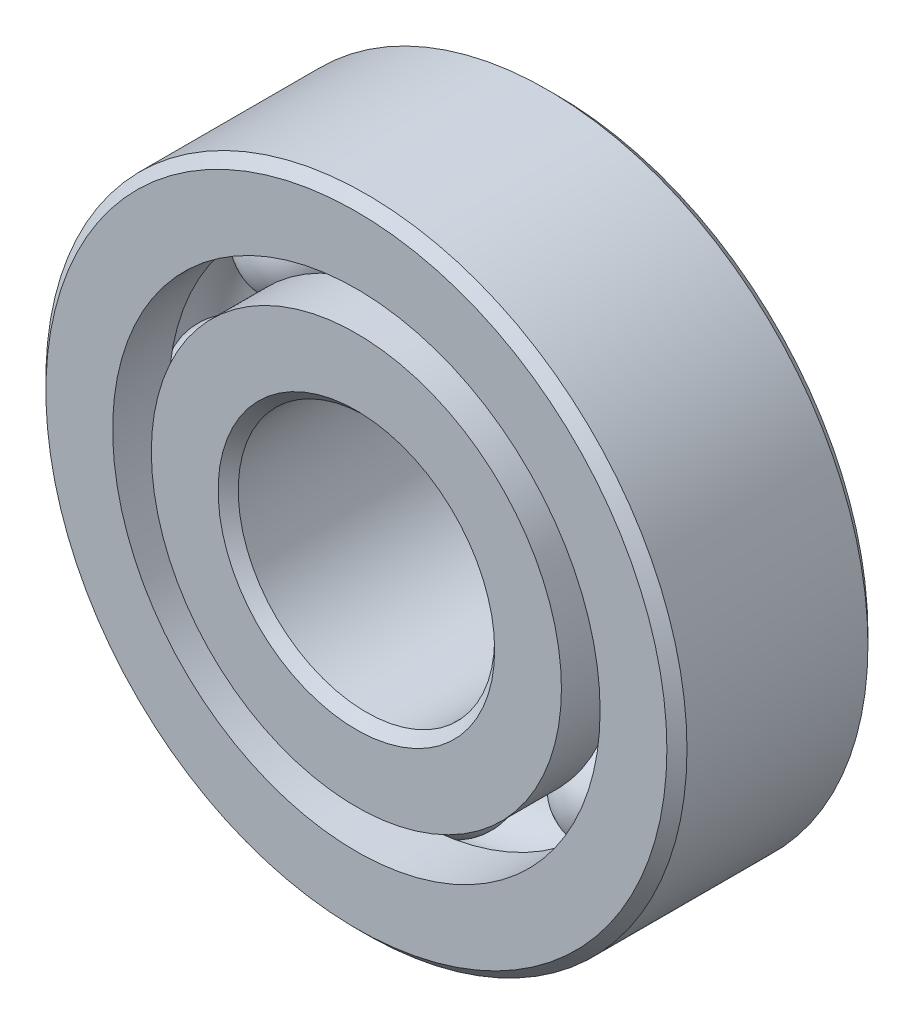
ISO-10303-21;
HEADER;
FILE_DESCRIPTION(('STEP AP214'),'2;1');
FILE_NAME('part.step','',(''),(''),'','','');
FILE_SCHEMA(('AUTOMOTIVE_DESIGN { 1 0 10303 214 1 1 1 1 }'));
ENDSEC;
DATA;
#1=APPLICATION_CONTEXT('core data for automotive mechanical design processes');
#2=APPLICATION_PROTOCOL_DEFINITION('international standard','automotive_design',2000,#1);
#3=PRODUCT_CONTEXT('',#1,'mechanical');
#4=PRODUCT('Part','Part','',(#3));
#5=PRODUCT_RELATED_PRODUCT_CATEGORY('part','',(#4));
#6=PRODUCT_DEFINITION_FORMATION('','',#4);
#7=PRODUCT_DEFINITION_CONTEXT('part definition',#1,'design');
#8=PRODUCT_DEFINITION('design','',#6,#7);
#9=PRODUCT_DEFINITION_SHAPE('','',#8);
#10=(LENGTH_UNIT() NAMED_UNIT(*) SI_UNIT(.MILLI.,.METRE.));
#11=(NAMED_UNIT(*) PLANE_ANGLE_UNIT() SI_UNIT($,.RADIAN.));
#12=(NAMED_UNIT(*) SI_UNIT($,.STERADIAN.) SOLID_ANGLE_UNIT());
#13=UNCERTAINTY_MEASURE_WITH_UNIT(LENGTH_MEASURE(1.E-05),#10,'distance_accuracy_value','');
#14=(GEOMETRIC_REPRESENTATION_CONTEXT(3) GLOBAL_UNCERTAINTY_ASSIGNED_CONTEXT((#13)) GLOBAL_UNIT_ASSIGNED_CONTEXT((#10,
#11,#12)) REPRESENTATION_CONTEXT('',''));
#15=CARTESIAN_POINT('',(0.,0.,0.));
#16=DIRECTION('',(0.,0.,1.));
#17=DIRECTION('',(1.,0.,0.));
#18=AXIS2_PLACEMENT_3D('',#15,#16,#17);
#19=CARTESIAN_POINT('',(-3.92886205296771,3.9288620529678,0.));
#20=DIRECTION('',(0.,0.,1.));
#21=DIRECTION('',(-0.707106781186539,0.707106781186556,0.));
#22=AXIS2_PLACEMENT_3D('',#19,#20,#21);
#23=SPHERICAL_SURFACE('',#22,1.20554465033679);
#24=CARTESIAN_POINT('',(-3.92886205296771,3.9288620529678,1.20554465033679));
#25=VERTEX_POINT('',#24);
#26=VERTEX_LOOP('',#25);
#27=FACE_BOUND('',#26,.T.);
#28=ADVANCED_FACE('F40',(#27),#23,.T.);
#29=CLOSED_SHELL('',(#28));
#30=MANIFOLD_SOLID_BREP('B2',#29);
#31=CARTESIAN_POINT('',(-5.55625,0.,0.));
#32=DIRECTION('',(0.,0.,1.));
#33=DIRECTION('',(-1.,0.,0.));
#34=AXIS2_PLACEMENT_3D('',#31,#32,#33);
#35=SPHERICAL_SURFACE('',#34,1.20554465033679);
#36=CARTESIAN_POINT('',(-5.55625,0.,1.20554465033679));
#37=VERTEX_POINT('',#36);
#38=VERTEX_LOOP('',#37);
#39=FACE_BOUND('',#38,.T.);
#40=ADVANCED_FACE('F61',(#39),#35,.T.);
#41=CLOSED_SHELL('',(#40));
#42=MANIFOLD_SOLID_BREP('B6',#41);
#43=CARTESIAN_POINT('',(-3.92886205296779,-3.92886205296772,0.));
#44=DIRECTION('',(0.,0.,1.));
#45=DIRECTION('',(-0.707106781186554,-0.707106781186541,0.));
#46=AXIS2_PLACEMENT_3D('',#43,#44,#45);
#47=SPHERICAL_SURFACE('',#46,1.20554465033679);
#48=CARTESIAN_POINT('',(-3.92886205296779,-3.92886205296772,1.20554465033679));
#49=VERTEX_POINT('',#48);
#50=VERTEX_LOOP('',#49);
#51=FACE_BOUND('',#50,.T.);
#52=ADVANCED_FACE('F82',(#51),#47,.T.);
#53=CLOSED_SHELL('',(#52));
#54=MANIFOLD_SOLID_BREP('B36',#53);
#55=CARTESIAN_POINT('',(0.,-5.55625,0.));
#56=DIRECTION('',(0.,0.,1.));
#57=DIRECTION('',(0.,-1.,0.));
#58=AXIS2_PLACEMENT_3D('',#55,#56,#57);
#59=SPHERICAL_SURFACE('',#58,1.20554465033679);
#60=CARTESIAN_POINT('',(0.,-5.55625,1.20554465033679));
#61=VERTEX_POINT('',#60);
#62=VERTEX_LOOP('',#61);
#63=FACE_BOUND('',#62,.T.);
#64=ADVANCED_FACE('F103',(#63),#59,.T.);
#65=CLOSED_SHELL('',(#64));
#66=MANIFOLD_SOLID_BREP('B57',#65);
#67=CARTESIAN_POINT('',(3.92886205296773,-3.92886205296777,0.));
#68=DIRECTION('',(0.,0.,1.));
#69=DIRECTION('',(0.707106781186544,-0.707106781186551,0.));
#70=AXIS2_PLACEMENT_3D('',#67,#68,#69);
#71=SPHERICAL_SURFACE('',#70,1.20554465033679);
#72=CARTESIAN_POINT('',(3.92886205296773,-3.92886205296777,1.20554465033679));
#73=VERTEX_POINT('',#72);
#74=VERTEX_LOOP('',#73);
#75=FACE_BOUND('',#74,.T.);
#76=ADVANCED_FACE('F124',(#75),#71,.T.);
#77=CLOSED_SHELL('',(#76));
#78=MANIFOLD_SOLID_BREP('B78',#77);
#79=CARTESIAN_POINT('',(5.55625,0.,0.));
#80=DIRECTION('',(0.,0.,1.));
#81=DIRECTION('',(1.,0.,0.));
#82=AXIS2_PLACEMENT_3D('',#79,#80,#81);
#83=SPHERICAL_SURFACE('',#82,1.20554465033679);
#84=CARTESIAN_POINT('',(5.55625,0.,1.20554465033679));
#85=VERTEX_POINT('',#84);
#86=VERTEX_LOOP('',#85);
#87=FACE_BOUND('',#86,.T.);
#88=ADVANCED_FACE('F145',(#87),#83,.T.);
#89=CLOSED_SHELL('',(#88));
#90=MANIFOLD_SOLID_BREP('B99',#89);
#91=CARTESIAN_POINT('',(3.92886205296776,3.92886205296775,0.));
#92=DIRECTION('',(0.,0.,1.));
#93=DIRECTION('',(0.707106781186549,0.707106781186546,0.));
#94=AXIS2_PLACEMENT_3D('',#91,#92,#93);
#95=SPHERICAL_SURFACE('',#94,1.20554465033679);
#96=CARTESIAN_POINT('',(3.92886205296776,3.92886205296775,1.20554465033679));
#97=VERTEX_POINT('',#96);
#98=VERTEX_LOOP('',#97);
#99=FACE_BOUND('',#98,.T.);
#100=ADVANCED_FACE('F166',(#99),#95,.T.);
#101=CLOSED_SHELL('',(#100));
#102=MANIFOLD_SOLID_BREP('B120',#101);
#103=CARTESIAN_POINT('',(0.,5.55625,0.));
#104=DIRECTION('',(0.,0.,1.));
#105=DIRECTION('',(0.,1.,0.));
#106=AXIS2_PLACEMENT_3D('',#103,#104,#105);
#107=SPHERICAL_SURFACE('',#106,1.20554465033679);
#108=CARTESIAN_POINT('',(0.,5.55625,1.20554465033679));
#109=VERTEX_POINT('',#108);
#110=VERTEX_LOOP('',#109);
#111=FACE_BOUND('',#110,.T.);
#112=ADVANCED_FACE('F189',(#111),#107,.T.);
#113=CLOSED_SHELL('',(#112));
#114=MANIFOLD_SOLID_BREP('B141',#113);
#115=CARTESIAN_POINT('',(0.,5.07727857142857,2.4892));
#116=DIRECTION('',(0.,0.,-1.));
#117=DIRECTION('',(-1.,0.,0.));
#118=AXIS2_PLACEMENT_3D('',#115,#116,#117);
#119=PLANE('',#118);
#120=CARTESIAN_POINT('',(0.,0.,2.4892));
#121=DIRECTION('',(0.,0.,1.));
#122=DIRECTION('',(1.,0.,0.));
#123=AXIS2_PLACEMENT_3D('',#120,#121,#122);
#124=CIRCLE('',#123,3.42392);
#125=CARTESIAN_POINT('',(3.42392,0.,2.4892));
#126=VERTEX_POINT('',#125);
#127=EDGE_CURVE('E237',#126,#126,#124,.T.);
#128=ORIENTED_EDGE('',*,*,#127,.F.);
#129=EDGE_LOOP('',(#128));
#130=FACE_BOUND('',#129,.T.);
#131=CARTESIAN_POINT('',(0.,0.,2.4892));
#132=DIRECTION('',(0.,0.,1.));
#133=DIRECTION('',(1.,0.,0.));
#134=AXIS2_PLACEMENT_3D('',#131,#132,#133);
#135=CIRCLE('',#134,5.07727857142857);
#136=CARTESIAN_POINT('',(5.07727857142857,0.,2.4892));
#137=VERTEX_POINT('',#136);
#138=EDGE_CURVE('E188',#137,#137,#135,.T.);
#139=ORIENTED_EDGE('',*,*,#138,.T.);
#140=EDGE_LOOP('',(#139));
#141=FACE_BOUND('',#140,.T.);
#142=ADVANCED_FACE('F209',(#130,#141),#119,.F.);
#143=CARTESIAN_POINT('',(0.,0.,2.4892));
#144=DIRECTION('',(0.,0.,1.));
#145=DIRECTION('',(1.,0.,0.));
#146=AXIS2_PLACEMENT_3D('',#143,#144,#145);
#147=CYLINDRICAL_SURFACE('',#146,5.07727857142857);
#148=ORIENTED_EDGE('',*,*,#138,.F.);
#149=EDGE_LOOP('',(#148));
#150=FACE_BOUND('',#149,.T.);
#151=CARTESIAN_POINT('',(0.,0.,1.10631111111111));
#152=DIRECTION('',(0.,0.,1.));
#153=DIRECTION('',(1.,0.,0.));
#154=AXIS2_PLACEMENT_3D('',#151,#152,#153);
#155=CIRCLE('',#154,5.07727857142857);
#156=CARTESIAN_POINT('',(5.07727857142857,0.,1.10631111111111));
#157=VERTEX_POINT('',#156);
#158=EDGE_CURVE('E215',#157,#157,#155,.T.);
#159=ORIENTED_EDGE('',*,*,#158,.T.);
#160=EDGE_LOOP('',(#159));
#161=FACE_BOUND('',#160,.T.);
#162=ADVANCED_FACE('F244',(#150,#161),#147,.T.);
#163=CARTESIAN_POINT('',(0.,0.,0.));
#164=DIRECTION('',(0.,0.,1.));
#165=DIRECTION('',(1.,0.,0.));
#166=AXIS2_PLACEMENT_3D('',#163,#164,#165);
#167=TOROIDAL_SURFACE('',#166,5.55625,1.20554465033679);
#168=ORIENTED_EDGE('',*,*,#158,.F.);
#169=EDGE_LOOP('',(#168));
#170=FACE_BOUND('',#169,.T.);
#171=CARTESIAN_POINT('',(0.,0.,-1.10631111111112));
#172=DIRECTION('',(0.,0.,1.));
#173=DIRECTION('',(1.,0.,0.));
#174=AXIS2_PLACEMENT_3D('',#171,#172,#173);
#175=CIRCLE('',#174,5.07727857142857);
#176=CARTESIAN_POINT('',(5.07727857142857,0.,-1.10631111111112));
#177=VERTEX_POINT('',#176);
#178=EDGE_CURVE('E219',#177,#177,#175,.T.);
#179=ORIENTED_EDGE('',*,*,#178,.T.);
#180=EDGE_LOOP('',(#179));
#181=FACE_BOUND('',#180,.T.);
#182=ADVANCED_FACE('F248',(#170,#181),#167,.F.);
#183=CARTESIAN_POINT('',(0.,0.,2.4892));
#184=DIRECTION('',(0.,0.,1.));
#185=DIRECTION('',(1.,0.,0.));
#186=AXIS2_PLACEMENT_3D('',#183,#184,#185);
#187=CYLINDRICAL_SURFACE('',#186,5.07727857142857);
#188=ORIENTED_EDGE('',*,*,#178,.F.);
#189=EDGE_LOOP('',(#188));
#190=FACE_BOUND('',#189,.T.);
#191=CARTESIAN_POINT('',(0.,0.,-2.4892));
#192=DIRECTION('',(0.,0.,1.));
#193=DIRECTION('',(1.,0.,0.));
#194=AXIS2_PLACEMENT_3D('',#191,#192,#193);
#195=CIRCLE('',#194,5.07727857142857);
#196=CARTESIAN_POINT('',(5.07727857142857,0.,-2.4892));
#197=VERTEX_POINT('',#196);
#198=EDGE_CURVE('E223',#197,#197,#195,.T.);
#199=ORIENTED_EDGE('',*,*,#198,.T.);
#200=EDGE_LOOP('',(#199));
#201=FACE_BOUND('',#200,.T.);
#202=ADVANCED_FACE('F253',(#190,#201),#187,.T.);
#203=CARTESIAN_POINT('',(0.,3.42392,-2.4892));
#204=DIRECTION('',(0.,0.,1.));
#205=DIRECTION('',(1.,0.,0.));
#206=AXIS2_PLACEMENT_3D('',#203,#204,#205);
#207=PLANE('',#206);
#208=ORIENTED_EDGE('',*,*,#198,.F.);
#209=EDGE_LOOP('',(#208));
#210=FACE_BOUND('',#209,.T.);
#211=CARTESIAN_POINT('',(0.,0.,-2.4892));
#212=DIRECTION('',(0.,0.,1.));
#213=DIRECTION('',(1.,0.,0.));
#214=AXIS2_PLACEMENT_3D('',#211,#212,#213);
#215=CIRCLE('',#214,3.42392);
#216=CARTESIAN_POINT('',(3.42392,0.,-2.4892));
#217=VERTEX_POINT('',#216);
#218=EDGE_CURVE('E228',#217,#217,#215,.T.);
#219=ORIENTED_EDGE('',*,*,#218,.T.);
#220=EDGE_LOOP('',(#219));
#221=FACE_BOUND('',#220,.T.);
#222=ADVANCED_FACE('F259',(#210,#221),#207,.F.);
#223=CARTESIAN_POINT('',(0.,0.,-2.24028));
#224=DIRECTION('',(0.,0.,-1.));
#225=DIRECTION('',(-1.,0.,0.));
#226=AXIS2_PLACEMENT_3D('',#223,#224,#225);
#227=CONICAL_SURFACE('',#226,3.175,0.785398163397453);
#228=ORIENTED_EDGE('',*,*,#218,.F.);
#229=EDGE_LOOP('',(#228));
#230=FACE_BOUND('',#229,.T.);
#231=CARTESIAN_POINT('',(0.,0.,-2.24028));
#232=DIRECTION('',(0.,0.,1.));
#233=DIRECTION('',(1.,0.,0.));
#234=AXIS2_PLACEMENT_3D('',#231,#232,#233);
#235=CIRCLE('',#234,3.175);
#236=CARTESIAN_POINT('',(3.175,0.,-2.24028));
#237=VERTEX_POINT('',#236);
#238=EDGE_CURVE('E231',#237,#237,#235,.T.);
#239=ORIENTED_EDGE('',*,*,#238,.T.);
#240=EDGE_LOOP('',(#239));
#241=FACE_BOUND('',#240,.T.);
#242=ADVANCED_FACE('F263',(#230,#241),#227,.F.);
#243=CARTESIAN_POINT('',(0.,0.,2.4892));
#244=DIRECTION('',(0.,0.,1.));
#245=DIRECTION('',(1.,0.,0.));
#246=AXIS2_PLACEMENT_3D('',#243,#244,#245);
#247=CYLINDRICAL_SURFACE('',#246,3.175);
#248=ORIENTED_EDGE('',*,*,#238,.F.);
#249=EDGE_LOOP('',(#248));
#250=FACE_BOUND('',#249,.T.);
#251=CARTESIAN_POINT('',(0.,0.,2.24028));
#252=DIRECTION('',(0.,0.,1.));
#253=DIRECTION('',(1.,0.,0.));
#254=AXIS2_PLACEMENT_3D('',#251,#252,#253);
#255=CIRCLE('',#254,3.175);
#256=CARTESIAN_POINT('',(3.175,0.,2.24028));
#257=VERTEX_POINT('',#256);
#258=EDGE_CURVE('E234',#257,#257,#255,.T.);
#259=ORIENTED_EDGE('',*,*,#258,.T.);
#260=EDGE_LOOP('',(#259));
#261=FACE_BOUND('',#260,.T.);
#262=ADVANCED_FACE('F267',(#250,#261),#247,.F.);
#263=CARTESIAN_POINT('',(0.,0.,2.4892));
#264=DIRECTION('',(0.,0.,1.));
#265=DIRECTION('',(1.,0.,0.));
#266=AXIS2_PLACEMENT_3D('',#263,#264,#265);
#267=CONICAL_SURFACE('',#266,3.42392,0.785398163397449);
#268=ORIENTED_EDGE('',*,*,#258,.F.);
#269=EDGE_LOOP('',(#268));
#270=FACE_BOUND('',#269,.T.);
#271=ORIENTED_EDGE('',*,*,#127,.T.);
#272=EDGE_LOOP('',(#271));
#273=FACE_BOUND('',#272,.T.);
#274=ADVANCED_FACE('F241',(#270,#273),#267,.F.);
#275=CLOSED_SHELL('',(#142,#162,#182,#202,#222,#242,#262,#274));
#276=MANIFOLD_SOLID_BREP('B162',#275);
#277=CARTESIAN_POINT('',(0.,0.,2.24028));
#278=DIRECTION('',(0.,0.,-1.));
#279=DIRECTION('',(-1.,0.,0.));
#280=AXIS2_PLACEMENT_3D('',#277,#278,#279);
#281=CONICAL_SURFACE('',#280,7.9375,0.785398163397446);
#282=CARTESIAN_POINT('',(0.,0.,2.4892));
#283=DIRECTION('',(0.,0.,1.));
#284=DIRECTION('',(1.,0.,0.));
#285=AXIS2_PLACEMENT_3D('',#282,#283,#284);
#286=CIRCLE('',#285,7.68858);
#287=CARTESIAN_POINT('',(7.68858,0.,2.4892));
#288=VERTEX_POINT('',#287);
#289=EDGE_CURVE('E359',#288,#288,#286,.T.);
#290=ORIENTED_EDGE('',*,*,#289,.F.);
#291=EDGE_LOOP('',(#290));
#292=FACE_BOUND('',#291,.T.);
#293=CARTESIAN_POINT('',(0.,0.,2.24028));
#294=DIRECTION('',(0.,0.,1.));
#295=DIRECTION('',(1.,0.,0.));
#296=AXIS2_PLACEMENT_3D('',#293,#294,#295);
#297=CIRCLE('',#296,7.9375);
#298=CARTESIAN_POINT('',(7.9375,0.,2.24028));
#299=VERTEX_POINT('',#298);
#300=EDGE_CURVE('E208',#299,#299,#297,.T.);
#301=ORIENTED_EDGE('',*,*,#300,.T.);
#302=EDGE_LOOP('',(#301));
#303=FACE_BOUND('',#302,.T.);
#304=ADVANCED_FACE('F331',(#292,#303),#281,.T.);
#305=CARTESIAN_POINT('',(0.,0.,2.4892));
#306=DIRECTION('',(0.,0.,1.));
#307=DIRECTION('',(1.,0.,0.));
#308=AXIS2_PLACEMENT_3D('',#305,#306,#307);
#309=CYLINDRICAL_SURFACE('',#308,7.9375);
#310=ORIENTED_EDGE('',*,*,#300,.F.);
#311=EDGE_LOOP('',(#310));
#312=FACE_BOUND('',#311,.T.);
#313=CARTESIAN_POINT('',(0.,0.,-2.24028));
#314=DIRECTION('',(0.,0.,1.));
#315=DIRECTION('',(1.,0.,0.));
#316=AXIS2_PLACEMENT_3D('',#313,#314,#315);
#317=CIRCLE('',#316,7.9375);
#318=CARTESIAN_POINT('',(7.9375,0.,-2.24028));
#319=VERTEX_POINT('',#318);
#320=EDGE_CURVE('E337',#319,#319,#317,.T.);
#321=ORIENTED_EDGE('',*,*,#320,.T.);
#322=EDGE_LOOP('',(#321));
#323=FACE_BOUND('',#322,.T.);
#324=ADVANCED_FACE('F366',(#312,#323),#309,.T.);
#325=CARTESIAN_POINT('',(0.,0.,-2.4892));
#326=DIRECTION('',(0.,0.,1.));
#327=DIRECTION('',(1.,0.,0.));
#328=AXIS2_PLACEMENT_3D('',#325,#326,#327);
#329=CONICAL_SURFACE('',#328,7.68858,0.785398163397445);
#330=ORIENTED_EDGE('',*,*,#320,.F.);
#331=EDGE_LOOP('',(#330));
#332=FACE_BOUND('',#331,.T.);
#333=CARTESIAN_POINT('',(0.,0.,-2.4892));
#334=DIRECTION('',(0.,0.,1.));
#335=DIRECTION('',(1.,0.,0.));
#336=AXIS2_PLACEMENT_3D('',#333,#334,#335);
#337=CIRCLE('',#336,7.68858);
#338=CARTESIAN_POINT('',(7.68858,0.,-2.4892));
#339=VERTEX_POINT('',#338);
#340=EDGE_CURVE('E341',#339,#339,#337,.T.);
#341=ORIENTED_EDGE('',*,*,#340,.T.);
#342=EDGE_LOOP('',(#341));
#343=FACE_BOUND('',#342,.T.);
#344=ADVANCED_FACE('F370',(#332,#343),#329,.T.);
#345=CARTESIAN_POINT('',(0.,7.68858,-2.4892));
#346=DIRECTION('',(0.,0.,1.));
#347=DIRECTION('',(1.,0.,0.));
#348=AXIS2_PLACEMENT_3D('',#345,#346,#347);
#349=PLANE('',#348);
#350=ORIENTED_EDGE('',*,*,#340,.F.);
#351=EDGE_LOOP('',(#350));
#352=FACE_BOUND('',#351,.T.);
#353=CARTESIAN_POINT('',(0.,0.,-2.4892));
#354=DIRECTION('',(0.,0.,1.));
#355=DIRECTION('',(1.,0.,0.));
#356=AXIS2_PLACEMENT_3D('',#353,#354,#355);
#357=CIRCLE('',#356,6.03522142857143);
#358=CARTESIAN_POINT('',(6.03522142857143,0.,-2.4892));
#359=VERTEX_POINT('',#358);
#360=EDGE_CURVE('E345',#359,#359,#357,.T.);
#361=ORIENTED_EDGE('',*,*,#360,.T.);
#362=EDGE_LOOP('',(#361));
#363=FACE_BOUND('',#362,.T.);
#364=ADVANCED_FACE('F375',(#352,#363),#349,.F.);
#365=CARTESIAN_POINT('',(0.,0.,2.4892));
#366=DIRECTION('',(0.,0.,1.));
#367=DIRECTION('',(1.,0.,0.));
#368=AXIS2_PLACEMENT_3D('',#365,#366,#367);
#369=CYLINDRICAL_SURFACE('',#368,6.03522142857143);
#370=ORIENTED_EDGE('',*,*,#360,.F.);
#371=EDGE_LOOP('',(#370));
#372=FACE_BOUND('',#371,.T.);
#373=CARTESIAN_POINT('',(0.,0.,-1.10631111111111));
#374=DIRECTION('',(0.,0.,1.));
#375=DIRECTION('',(1.,0.,0.));
#376=AXIS2_PLACEMENT_3D('',#373,#374,#375);
#377=CIRCLE('',#376,6.03522142857143);
#378=CARTESIAN_POINT('',(6.03522142857143,0.,-1.10631111111111));
#379=VERTEX_POINT('',#378);
#380=EDGE_CURVE('E350',#379,#379,#377,.T.);
#381=ORIENTED_EDGE('',*,*,#380,.T.);
#382=EDGE_LOOP('',(#381));
#383=FACE_BOUND('',#382,.T.);
#384=ADVANCED_FACE('F381',(#372,#383),#369,.F.);
#385=CARTESIAN_POINT('',(0.,0.,0.));
#386=DIRECTION('',(0.,0.,1.));
#387=DIRECTION('',(1.,0.,0.));
#388=AXIS2_PLACEMENT_3D('',#385,#386,#387);
#389=TOROIDAL_SURFACE('',#388,5.55625,1.20554465033679);
#390=ORIENTED_EDGE('',*,*,#380,.F.);
#391=EDGE_LOOP('',(#390));
#392=FACE_BOUND('',#391,.T.);
#393=CARTESIAN_POINT('',(0.,0.,1.10631111111111));
#394=DIRECTION('',(0.,0.,1.));
#395=DIRECTION('',(1.,0.,0.));
#396=AXIS2_PLACEMENT_3D('',#393,#394,#395);
#397=CIRCLE('',#396,6.03522142857143);
#398=CARTESIAN_POINT('',(6.03522142857143,0.,1.10631111111111));
#399=VERTEX_POINT('',#398);
#400=EDGE_CURVE('E353',#399,#399,#397,.T.);
#401=ORIENTED_EDGE('',*,*,#400,.T.);
#402=EDGE_LOOP('',(#401));
#403=FACE_BOUND('',#402,.T.);
#404=ADVANCED_FACE('F385',(#392,#403),#389,.F.);
#405=CARTESIAN_POINT('',(0.,0.,2.4892));
#406=DIRECTION('',(0.,0.,1.));
#407=DIRECTION('',(1.,0.,0.));
#408=AXIS2_PLACEMENT_3D('',#405,#406,#407);
#409=CYLINDRICAL_SURFACE('',#408,6.03522142857143);
#410=ORIENTED_EDGE('',*,*,#400,.F.);
#411=EDGE_LOOP('',(#410));
#412=FACE_BOUND('',#411,.T.);
#413=CARTESIAN_POINT('',(0.,0.,2.4892));
#414=DIRECTION('',(0.,0.,1.));
#415=DIRECTION('',(1.,0.,0.));
#416=AXIS2_PLACEMENT_3D('',#413,#414,#415);
#417=CIRCLE('',#416,6.03522142857143);
#418=CARTESIAN_POINT('',(6.03522142857143,0.,2.4892));
#419=VERTEX_POINT('',#418);
#420=EDGE_CURVE('E356',#419,#419,#417,.T.);
#421=ORIENTED_EDGE('',*,*,#420,.T.);
#422=EDGE_LOOP('',(#421));
#423=FACE_BOUND('',#422,.T.);
#424=ADVANCED_FACE('F389',(#412,#423),#409,.F.);
#425=CARTESIAN_POINT('',(0.,7.68858,2.4892));
#426=DIRECTION('',(0.,0.,-1.));
#427=DIRECTION('',(-1.,0.,0.));
#428=AXIS2_PLACEMENT_3D('',#425,#426,#427);
#429=PLANE('',#428);
#430=ORIENTED_EDGE('',*,*,#420,.F.);
#431=EDGE_LOOP('',(#430));
#432=FACE_BOUND('',#431,.T.);
#433=ORIENTED_EDGE('',*,*,#289,.T.);
#434=EDGE_LOOP('',(#433));
#435=FACE_BOUND('',#434,.T.);
#436=ADVANCED_FACE('F363',(#432,#435),#429,.F.);
#437=CLOSED_SHELL('',(#304,#324,#344,#364,#384,#404,#424,#436));
#438=MANIFOLD_SOLID_BREP('B183',#437);
#439=ADVANCED_BREP_SHAPE_REPRESENTATION('',(#18,#30,#42,#54,#66,#78,#90,#102,#114,#276,#438),#14);
#440=SHAPE_DEFINITION_REPRESENTATION(#9,#439);
ENDSEC;
END-ISO-10303-21;
